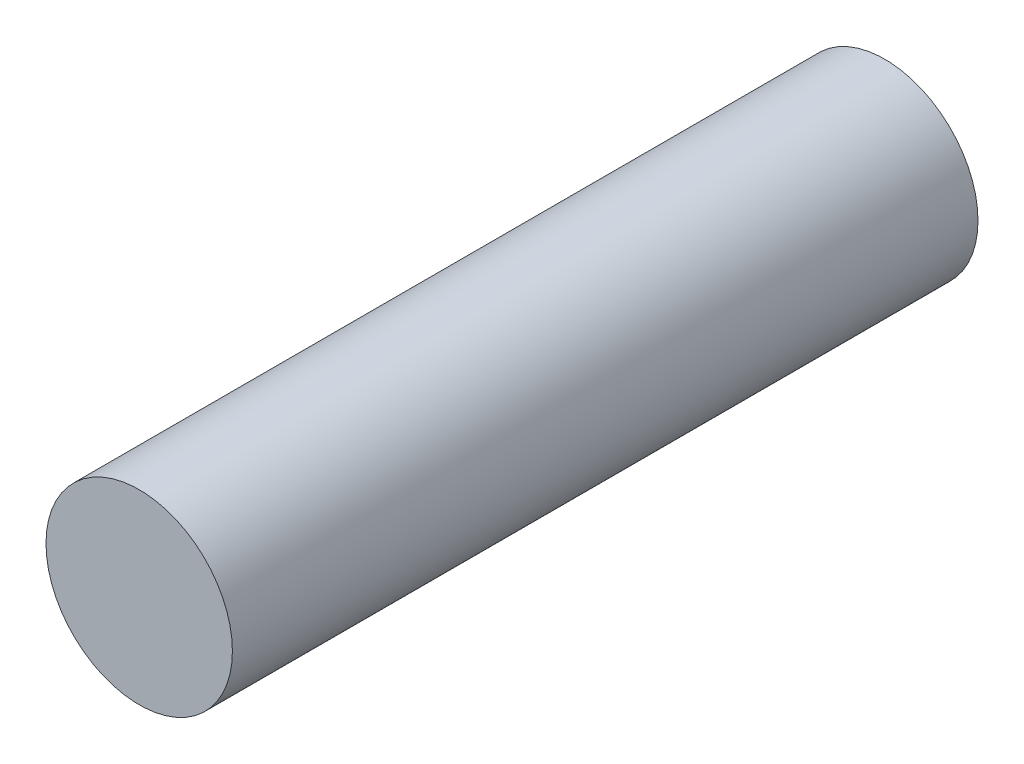
ISO-10303-21;
HEADER;
FILE_DESCRIPTION(('STEP AP214'),'2;1');
FILE_NAME('part.step','',(''),(''),'','','');
FILE_SCHEMA(('AUTOMOTIVE_DESIGN { 1 0 10303 214 1 1 1 1 }'));
ENDSEC;
DATA;
#1=APPLICATION_CONTEXT('core data for automotive mechanical design processes');
#2=APPLICATION_PROTOCOL_DEFINITION('international standard','automotive_design',2000,#1);
#3=PRODUCT_CONTEXT('',#1,'mechanical');
#4=PRODUCT('Part','Part','',(#3));
#5=PRODUCT_RELATED_PRODUCT_CATEGORY('part','',(#4));
#6=PRODUCT_DEFINITION_FORMATION('','',#4);
#7=PRODUCT_DEFINITION_CONTEXT('part definition',#1,'design');
#8=PRODUCT_DEFINITION('design','',#6,#7);
#9=PRODUCT_DEFINITION_SHAPE('','',#8);
#10=(LENGTH_UNIT() NAMED_UNIT(*) SI_UNIT(.MILLI.,.METRE.));
#11=(NAMED_UNIT(*) PLANE_ANGLE_UNIT() SI_UNIT($,.RADIAN.));
#12=(NAMED_UNIT(*) SI_UNIT($,.STERADIAN.) SOLID_ANGLE_UNIT());
#13=UNCERTAINTY_MEASURE_WITH_UNIT(LENGTH_MEASURE(1.E-05),#10,'distance_accuracy_value','');
#14=(GEOMETRIC_REPRESENTATION_CONTEXT(3) GLOBAL_UNCERTAINTY_ASSIGNED_CONTEXT((#13)) GLOBAL_UNIT_ASSIGNED_CONTEXT((#10,
#11,#12)) REPRESENTATION_CONTEXT('',''));
#15=CARTESIAN_POINT('',(0.,0.,0.));
#16=DIRECTION('',(0.,0.,1.));
#17=DIRECTION('',(1.,0.,0.));
#18=AXIS2_PLACEMENT_3D('',#15,#16,#17);
#19=CARTESIAN_POINT('',(0.,0.,50.8));
#20=DIRECTION('',(0.,0.,-1.));
#21=DIRECTION('',(-1.,0.,0.));
#22=AXIS2_PLACEMENT_3D('',#19,#20,#21);
#23=CYLINDRICAL_SURFACE('',#22,6.35);
#24=CARTESIAN_POINT('',(0.,0.,50.8));
#25=DIRECTION('',(0.,0.,1.));
#26=DIRECTION('',(1.,0.,0.));
#27=AXIS2_PLACEMENT_3D('',#24,#25,#26);
#28=CIRCLE('',#27,6.35);
#29=CARTESIAN_POINT('',(6.35,0.,50.8));
#30=VERTEX_POINT('',#29);
#31=EDGE_CURVE('E10',#30,#30,#28,.T.);
#32=ORIENTED_EDGE('',*,*,#31,.F.);
#33=EDGE_LOOP('',(#32));
#34=FACE_BOUND('',#33,.T.);
#35=CARTESIAN_POINT('',(0.,0.,0.));
#36=DIRECTION('',(0.,0.,1.));
#37=DIRECTION('',(1.,0.,0.));
#38=AXIS2_PLACEMENT_3D('',#35,#36,#37);
#39=CIRCLE('',#38,6.35);
#40=CARTESIAN_POINT('',(6.35,0.,0.));
#41=VERTEX_POINT('',#40);
#42=EDGE_CURVE('E34',#41,#41,#39,.T.);
#43=ORIENTED_EDGE('',*,*,#42,.T.);
#44=EDGE_LOOP('',(#43));
#45=FACE_BOUND('',#44,.T.);
#46=ADVANCED_FACE('F31',(#34,#45),#23,.T.);
#47=CARTESIAN_POINT('',(0.,0.,50.8));
#48=DIRECTION('',(0.,0.,1.));
#49=DIRECTION('',(1.,0.,0.));
#50=AXIS2_PLACEMENT_3D('',#47,#48,#49);
#51=PLANE('',#50);
#52=ORIENTED_EDGE('',*,*,#31,.T.);
#53=EDGE_LOOP('',(#52));
#54=FACE_BOUND('',#53,.T.);
#55=ADVANCED_FACE('F60',(#54),#51,.T.);
#56=CARTESIAN_POINT('',(0.,0.,0.));
#57=DIRECTION('',(0.,0.,1.));
#58=DIRECTION('',(1.,0.,0.));
#59=AXIS2_PLACEMENT_3D('',#56,#57,#58);
#60=PLANE('',#59);
#61=CARTESIAN_POINT('',(0.,0.,0.));
#62=DIRECTION('',(0.,0.,-1.));
#63=DIRECTION('',(-1.,0.,0.));
#64=AXIS2_PLACEMENT_3D('',#61,#62,#63);
#65=CIRCLE('',#64,1.5875);
#66=CARTESIAN_POINT('',(-1.5875,0.,0.));
#67=VERTEX_POINT('',#66);
#68=EDGE_CURVE('E43',#67,#67,#65,.T.);
#69=ORIENTED_EDGE('',*,*,#68,.F.);
#70=EDGE_LOOP('',(#69));
#71=FACE_BOUND('',#70,.T.);
#72=ORIENTED_EDGE('',*,*,#42,.F.);
#73=EDGE_LOOP('',(#72));
#74=FACE_BOUND('',#73,.T.);
#75=ADVANCED_FACE('F54',(#71,#74),#60,.F.);
#76=CARTESIAN_POINT('',(0.,0.,12.7));
#77=DIRECTION('',(0.,0.,-1.));
#78=DIRECTION('',(-1.,0.,0.));
#79=AXIS2_PLACEMENT_3D('',#76,#77,#78);
#80=CYLINDRICAL_SURFACE('',#79,1.5875);
#81=CARTESIAN_POINT('',(0.,0.,12.7));
#82=DIRECTION('',(0.,0.,-1.));
#83=DIRECTION('',(-1.,0.,0.));
#84=AXIS2_PLACEMENT_3D('',#81,#82,#83);
#85=CIRCLE('',#84,1.5875);
#86=CARTESIAN_POINT('',(-1.5875,0.,12.7));
#87=VERTEX_POINT('',#86);
#88=EDGE_CURVE('E41',#87,#87,#85,.T.);
#89=ORIENTED_EDGE('',*,*,#88,.F.);
#90=EDGE_LOOP('',(#89));
#91=FACE_BOUND('',#90,.T.);
#92=ORIENTED_EDGE('',*,*,#68,.T.);
#93=EDGE_LOOP('',(#92));
#94=FACE_BOUND('',#93,.T.);
#95=ADVANCED_FACE('F51',(#91,#94),#80,.F.);
#96=CARTESIAN_POINT('',(0.,0.,12.7));
#97=DIRECTION('',(0.,0.,-1.));
#98=DIRECTION('',(-1.,0.,0.));
#99=AXIS2_PLACEMENT_3D('',#96,#97,#98);
#100=PLANE('',#99);
#101=ORIENTED_EDGE('',*,*,#88,.T.);
#102=EDGE_LOOP('',(#101));
#103=FACE_BOUND('',#102,.T.);
#104=ADVANCED_FACE('F49',(#103),#100,.T.);
#105=CLOSED_SHELL('',(#46,#55,#75,#95,#104));
#106=MANIFOLD_SOLID_BREP('B2',#105);
#107=ADVANCED_BREP_SHAPE_REPRESENTATION('',(#18,#106),#14);
#108=SHAPE_DEFINITION_REPRESENTATION(#9,#107);
ENDSEC;
END-ISO-10303-21;
